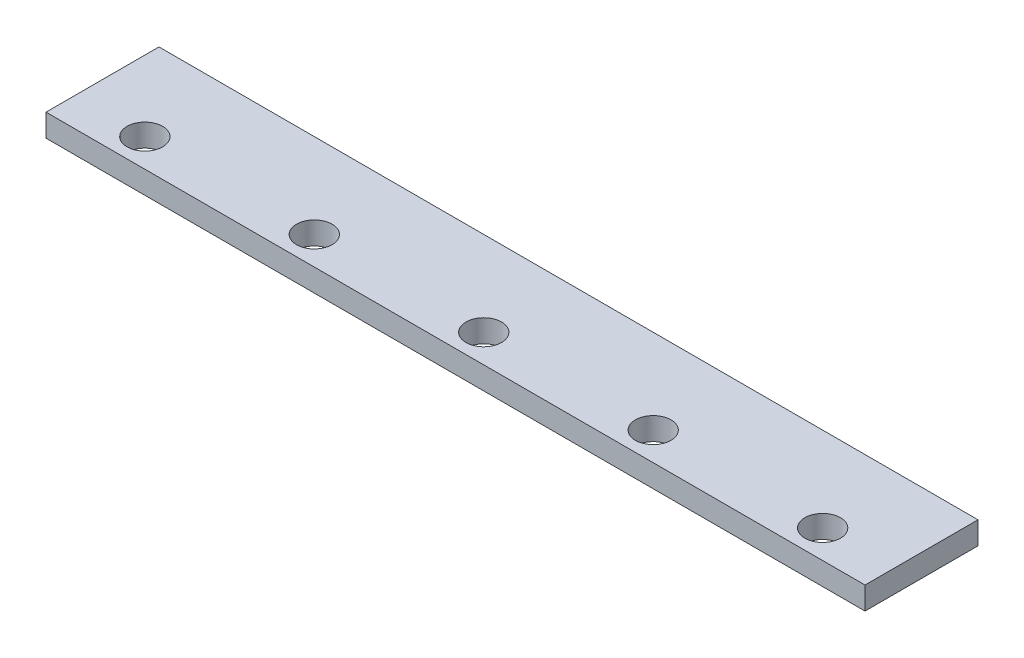
ISO-10303-21;
HEADER;
FILE_DESCRIPTION(('STEP AP214'),'2;1');
FILE_NAME('part.step','',(''),(''),'','','');
FILE_SCHEMA(('AUTOMOTIVE_DESIGN { 1 0 10303 214 1 1 1 1 }'));
ENDSEC;
DATA;
#1=APPLICATION_CONTEXT('core data for automotive mechanical design processes');
#2=APPLICATION_PROTOCOL_DEFINITION('international standard','automotive_design',2000,#1);
#3=PRODUCT_CONTEXT('',#1,'mechanical');
#4=PRODUCT('Part','Part','',(#3));
#5=PRODUCT_RELATED_PRODUCT_CATEGORY('part','',(#4));
#6=PRODUCT_DEFINITION_FORMATION('','',#4);
#7=PRODUCT_DEFINITION_CONTEXT('part definition',#1,'design');
#8=PRODUCT_DEFINITION('design','',#6,#7);
#9=PRODUCT_DEFINITION_SHAPE('','',#8);
#10=(LENGTH_UNIT() NAMED_UNIT(*) SI_UNIT(.MILLI.,.METRE.));
#11=(NAMED_UNIT(*) PLANE_ANGLE_UNIT() SI_UNIT($,.RADIAN.));
#12=(NAMED_UNIT(*) SI_UNIT($,.STERADIAN.) SOLID_ANGLE_UNIT());
#13=UNCERTAINTY_MEASURE_WITH_UNIT(LENGTH_MEASURE(1.E-05),#10,'distance_accuracy_value','');
#14=(GEOMETRIC_REPRESENTATION_CONTEXT(3) GLOBAL_UNCERTAINTY_ASSIGNED_CONTEXT((#13)) GLOBAL_UNIT_ASSIGNED_CONTEXT((#10,
#11,#12)) REPRESENTATION_CONTEXT('',''));
#15=CARTESIAN_POINT('',(0.,0.,0.));
#16=DIRECTION('',(0.,0.,1.));
#17=DIRECTION('',(1.,0.,0.));
#18=AXIS2_PLACEMENT_3D('',#15,#16,#17);
#19=CARTESIAN_POINT('',(0.,16.,0.));
#20=DIRECTION('',(0.,1.,0.));
#21=DIRECTION('',(0.,0.,1.));
#22=AXIS2_PLACEMENT_3D('',#19,#20,#21);
#23=PLANE('',#22);
#24=CARTESIAN_POINT('',(410.,16.,-20.));
#25=DIRECTION('',(0.,1.,0.));
#26=DIRECTION('',(0.,0.,1.));
#27=AXIS2_PLACEMENT_3D('',#24,#25,#26);
#28=CIRCLE('',#27,12.6);
#29=CARTESIAN_POINT('',(410.,16.,-7.40000000000001));
#30=VERTEX_POINT('',#29);
#31=EDGE_CURVE('E127',#30,#30,#28,.T.);
#32=ORIENTED_EDGE('',*,*,#31,.F.);
#33=EDGE_LOOP('',(#32));
#34=FACE_BOUND('',#33,.T.);
#35=CARTESIAN_POINT('',(170.,16.,-20.));
#36=DIRECTION('',(0.,1.,0.));
#37=DIRECTION('',(0.,0.,1.));
#38=AXIS2_PLACEMENT_3D('',#35,#36,#37);
#39=CIRCLE('',#38,12.6);
#40=CARTESIAN_POINT('',(170.,16.,-7.40000000000003));
#41=VERTEX_POINT('',#40);
#42=EDGE_CURVE('E115',#41,#41,#39,.T.);
#43=ORIENTED_EDGE('',*,*,#42,.F.);
#44=EDGE_LOOP('',(#43));
#45=FACE_BOUND('',#44,.T.);
#46=DIRECTION('',(0.,0.,1.));
#47=VECTOR('',#46,1.);
#48=CARTESIAN_POINT('',(0.,16.,-80.));
#49=LINE('',#48,#47);
#50=CARTESIAN_POINT('',(0.,16.,-80.));
#51=VERTEX_POINT('',#50);
#52=CARTESIAN_POINT('',(0.,16.,0.));
#53=VERTEX_POINT('',#52);
#54=EDGE_CURVE('E85',#51,#53,#49,.T.);
#55=ORIENTED_EDGE('',*,*,#54,.T.);
#56=DIRECTION('',(1.,0.,0.));
#57=VECTOR('',#56,1.);
#58=CARTESIAN_POINT('',(0.,16.,0.));
#59=LINE('',#58,#57);
#60=CARTESIAN_POINT('',(580.,16.,0.));
#61=VERTEX_POINT('',#60);
#62=EDGE_CURVE('E80',#53,#61,#59,.T.);
#63=ORIENTED_EDGE('',*,*,#62,.T.);
#64=DIRECTION('',(0.,0.,-1.));
#65=VECTOR('',#64,1.);
#66=CARTESIAN_POINT('',(580.,16.,0.));
#67=LINE('',#66,#65);
#68=CARTESIAN_POINT('',(580.,16.,-80.));
#69=VERTEX_POINT('',#68);
#70=EDGE_CURVE('E83',#61,#69,#67,.T.);
#71=ORIENTED_EDGE('',*,*,#70,.T.);
#72=DIRECTION('',(-1.,0.,0.));
#73=VECTOR('',#72,1.);
#74=CARTESIAN_POINT('',(580.,16.,-80.));
#75=LINE('',#74,#73);
#76=EDGE_CURVE('E50',#69,#51,#75,.T.);
#77=ORIENTED_EDGE('',*,*,#76,.T.);
#78=EDGE_LOOP('',(#55,#63,#71,#77));
#79=FACE_BOUND('',#78,.T.);
#80=CARTESIAN_POINT('',(50.,16.,-20.));
#81=DIRECTION('',(0.,1.,0.));
#82=DIRECTION('',(0.,0.,1.));
#83=AXIS2_PLACEMENT_3D('',#80,#81,#82);
#84=CIRCLE('',#83,12.6);
#85=CARTESIAN_POINT('',(50.,16.,-7.40000000000001));
#86=VERTEX_POINT('',#85);
#87=EDGE_CURVE('E100',#86,#86,#84,.T.);
#88=ORIENTED_EDGE('',*,*,#87,.F.);
#89=EDGE_LOOP('',(#88));
#90=FACE_BOUND('',#89,.T.);
#91=CARTESIAN_POINT('',(290.,16.,-20.));
#92=DIRECTION('',(0.,1.,0.));
#93=DIRECTION('',(0.,0.,1.));
#94=AXIS2_PLACEMENT_3D('',#91,#92,#93);
#95=CIRCLE('',#94,12.6);
#96=CARTESIAN_POINT('',(290.,16.,-7.40000000000001));
#97=VERTEX_POINT('',#96);
#98=EDGE_CURVE('E121',#97,#97,#95,.T.);
#99=ORIENTED_EDGE('',*,*,#98,.F.);
#100=EDGE_LOOP('',(#99));
#101=FACE_BOUND('',#100,.T.);
#102=CARTESIAN_POINT('',(530.,16.,-20.));
#103=DIRECTION('',(0.,1.,0.));
#104=DIRECTION('',(0.,0.,1.));
#105=AXIS2_PLACEMENT_3D('',#102,#103,#104);
#106=CIRCLE('',#105,12.5999999999999);
#107=CARTESIAN_POINT('',(530.,16.,-7.40000000000006));
#108=VERTEX_POINT('',#107);
#109=EDGE_CURVE('E133',#108,#108,#106,.T.);
#110=ORIENTED_EDGE('',*,*,#109,.F.);
#111=EDGE_LOOP('',(#110));
#112=FACE_BOUND('',#111,.T.);
#113=ADVANCED_FACE('F33',(#34,#45,#79,#90,#101,#112),#23,.T.);
#114=CARTESIAN_POINT('',(0.,0.,0.));
#115=DIRECTION('',(0.,1.,0.));
#116=DIRECTION('',(0.,0.,1.));
#117=AXIS2_PLACEMENT_3D('',#114,#115,#116);
#118=PLANE('',#117);
#119=DIRECTION('',(0.,0.,1.));
#120=VECTOR('',#119,1.);
#121=CARTESIAN_POINT('',(0.,0.,-80.));
#122=LINE('',#121,#120);
#123=CARTESIAN_POINT('',(0.,0.,-80.));
#124=VERTEX_POINT('',#123);
#125=CARTESIAN_POINT('',(0.,0.,0.));
#126=VERTEX_POINT('',#125);
#127=EDGE_CURVE('E97',#124,#126,#122,.T.);
#128=ORIENTED_EDGE('',*,*,#127,.F.);
#129=DIRECTION('',(-1.,0.,0.));
#130=VECTOR('',#129,1.);
#131=CARTESIAN_POINT('',(580.,0.,-80.));
#132=LINE('',#131,#130);
#133=CARTESIAN_POINT('',(580.,0.,-80.));
#134=VERTEX_POINT('',#133);
#135=EDGE_CURVE('E73',#134,#124,#132,.T.);
#136=ORIENTED_EDGE('',*,*,#135,.F.);
#137=DIRECTION('',(0.,0.,-1.));
#138=VECTOR('',#137,1.);
#139=CARTESIAN_POINT('',(580.,0.,0.));
#140=LINE('',#139,#138);
#141=CARTESIAN_POINT('',(580.,0.,0.));
#142=VERTEX_POINT('',#141);
#143=EDGE_CURVE('E67',#142,#134,#140,.T.);
#144=ORIENTED_EDGE('',*,*,#143,.F.);
#145=DIRECTION('',(1.,0.,0.));
#146=VECTOR('',#145,1.);
#147=CARTESIAN_POINT('',(0.,0.,0.));
#148=LINE('',#147,#146);
#149=EDGE_CURVE('E89',#126,#142,#148,.T.);
#150=ORIENTED_EDGE('',*,*,#149,.F.);
#151=EDGE_LOOP('',(#128,#136,#144,#150));
#152=FACE_BOUND('',#151,.T.);
#153=CARTESIAN_POINT('',(50.,0.,-20.));
#154=DIRECTION('',(0.,1.,0.));
#155=DIRECTION('',(0.,0.,1.));
#156=AXIS2_PLACEMENT_3D('',#153,#154,#155);
#157=CIRCLE('',#156,12.6);
#158=CARTESIAN_POINT('',(50.,0.,-7.40000000000001));
#159=VERTEX_POINT('',#158);
#160=EDGE_CURVE('E112',#159,#159,#157,.T.);
#161=ORIENTED_EDGE('',*,*,#160,.T.);
#162=EDGE_LOOP('',(#161));
#163=FACE_BOUND('',#162,.T.);
#164=CARTESIAN_POINT('',(170.,0.,-20.));
#165=DIRECTION('',(0.,1.,0.));
#166=DIRECTION('',(0.,0.,1.));
#167=AXIS2_PLACEMENT_3D('',#164,#165,#166);
#168=CIRCLE('',#167,12.6);
#169=CARTESIAN_POINT('',(170.,0.,-7.40000000000003));
#170=VERTEX_POINT('',#169);
#171=EDGE_CURVE('E118',#170,#170,#168,.T.);
#172=ORIENTED_EDGE('',*,*,#171,.T.);
#173=EDGE_LOOP('',(#172));
#174=FACE_BOUND('',#173,.T.);
#175=CARTESIAN_POINT('',(290.,0.,-20.));
#176=DIRECTION('',(0.,1.,0.));
#177=DIRECTION('',(0.,0.,1.));
#178=AXIS2_PLACEMENT_3D('',#175,#176,#177);
#179=CIRCLE('',#178,12.6);
#180=CARTESIAN_POINT('',(290.,0.,-7.40000000000001));
#181=VERTEX_POINT('',#180);
#182=EDGE_CURVE('E124',#181,#181,#179,.T.);
#183=ORIENTED_EDGE('',*,*,#182,.T.);
#184=EDGE_LOOP('',(#183));
#185=FACE_BOUND('',#184,.T.);
#186=CARTESIAN_POINT('',(410.,0.,-20.));
#187=DIRECTION('',(0.,1.,0.));
#188=DIRECTION('',(0.,0.,1.));
#189=AXIS2_PLACEMENT_3D('',#186,#187,#188);
#190=CIRCLE('',#189,12.6);
#191=CARTESIAN_POINT('',(410.,0.,-7.40000000000001));
#192=VERTEX_POINT('',#191);
#193=EDGE_CURVE('E130',#192,#192,#190,.T.);
#194=ORIENTED_EDGE('',*,*,#193,.T.);
#195=EDGE_LOOP('',(#194));
#196=FACE_BOUND('',#195,.T.);
#197=CARTESIAN_POINT('',(530.,0.,-20.));
#198=DIRECTION('',(0.,1.,0.));
#199=DIRECTION('',(0.,0.,1.));
#200=AXIS2_PLACEMENT_3D('',#197,#198,#199);
#201=CIRCLE('',#200,12.5999999999999);
#202=CARTESIAN_POINT('',(530.,0.,-7.40000000000006));
#203=VERTEX_POINT('',#202);
#204=EDGE_CURVE('E136',#203,#203,#201,.T.);
#205=ORIENTED_EDGE('',*,*,#204,.T.);
#206=EDGE_LOOP('',(#205));
#207=FACE_BOUND('',#206,.T.);
#208=ADVANCED_FACE('F108',(#152,#163,#174,#185,#196,#207),#118,.F.);
#209=CARTESIAN_POINT('',(0.,16.,-80.));
#210=DIRECTION('',(1.,0.,0.));
#211=DIRECTION('',(0.,0.,-1.));
#212=AXIS2_PLACEMENT_3D('',#209,#210,#211);
#213=PLANE('',#212);
#214=ORIENTED_EDGE('',*,*,#127,.T.);
#215=DIRECTION('',(0.,-1.,0.));
#216=VECTOR('',#215,1.);
#217=CARTESIAN_POINT('',(0.,16.,0.));
#218=LINE('',#217,#216);
#219=EDGE_CURVE('E11',#53,#126,#218,.T.);
#220=ORIENTED_EDGE('',*,*,#219,.F.);
#221=ORIENTED_EDGE('',*,*,#54,.F.);
#222=DIRECTION('',(0.,-1.,0.));
#223=VECTOR('',#222,1.);
#224=CARTESIAN_POINT('',(0.,16.,-80.));
#225=LINE('',#224,#223);
#226=EDGE_CURVE('E93',#51,#124,#225,.T.);
#227=ORIENTED_EDGE('',*,*,#226,.T.);
#228=EDGE_LOOP('',(#214,#220,#221,#227));
#229=FACE_BOUND('',#228,.T.);
#230=ADVANCED_FACE('F35',(#229),#213,.F.);
#231=CARTESIAN_POINT('',(0.,16.,0.));
#232=DIRECTION('',(0.,0.,-1.));
#233=DIRECTION('',(-1.,0.,0.));
#234=AXIS2_PLACEMENT_3D('',#231,#232,#233);
#235=PLANE('',#234);
#236=ORIENTED_EDGE('',*,*,#149,.T.);
#237=DIRECTION('',(0.,-1.,0.));
#238=VECTOR('',#237,1.);
#239=CARTESIAN_POINT('',(580.,16.,0.));
#240=LINE('',#239,#238);
#241=EDGE_CURVE('E42',#61,#142,#240,.T.);
#242=ORIENTED_EDGE('',*,*,#241,.F.);
#243=ORIENTED_EDGE('',*,*,#62,.F.);
#244=ORIENTED_EDGE('',*,*,#219,.T.);
#245=EDGE_LOOP('',(#236,#242,#243,#244));
#246=FACE_BOUND('',#245,.T.);
#247=ADVANCED_FACE('F88',(#246),#235,.F.);
#248=CARTESIAN_POINT('',(580.,16.,0.));
#249=DIRECTION('',(-1.,0.,0.));
#250=DIRECTION('',(0.,0.,1.));
#251=AXIS2_PLACEMENT_3D('',#248,#249,#250);
#252=PLANE('',#251);
#253=ORIENTED_EDGE('',*,*,#143,.T.);
#254=DIRECTION('',(0.,-1.,0.));
#255=VECTOR('',#254,1.);
#256=CARTESIAN_POINT('',(580.,16.,-80.));
#257=LINE('',#256,#255);
#258=EDGE_CURVE('E90',#69,#134,#257,.T.);
#259=ORIENTED_EDGE('',*,*,#258,.F.);
#260=ORIENTED_EDGE('',*,*,#70,.F.);
#261=ORIENTED_EDGE('',*,*,#241,.T.);
#262=EDGE_LOOP('',(#253,#259,#260,#261));
#263=FACE_BOUND('',#262,.T.);
#264=ADVANCED_FACE('F91',(#263),#252,.F.);
#265=CARTESIAN_POINT('',(580.,16.,-80.));
#266=DIRECTION('',(0.,0.,1.));
#267=DIRECTION('',(1.,0.,0.));
#268=AXIS2_PLACEMENT_3D('',#265,#266,#267);
#269=PLANE('',#268);
#270=ORIENTED_EDGE('',*,*,#135,.T.);
#271=ORIENTED_EDGE('',*,*,#226,.F.);
#272=ORIENTED_EDGE('',*,*,#76,.F.);
#273=ORIENTED_EDGE('',*,*,#258,.T.);
#274=EDGE_LOOP('',(#270,#271,#272,#273));
#275=FACE_BOUND('',#274,.T.);
#276=ADVANCED_FACE('F105',(#275),#269,.F.);
#277=CARTESIAN_POINT('',(50.,16.,-20.));
#278=DIRECTION('',(0.,-1.,0.));
#279=DIRECTION('',(0.,0.,-1.));
#280=AXIS2_PLACEMENT_3D('',#277,#278,#279);
#281=CYLINDRICAL_SURFACE('',#280,12.6);
#282=ORIENTED_EDGE('',*,*,#87,.T.);
#283=EDGE_LOOP('',(#282));
#284=FACE_BOUND('',#283,.T.);
#285=ORIENTED_EDGE('',*,*,#160,.F.);
#286=EDGE_LOOP('',(#285));
#287=FACE_BOUND('',#286,.T.);
#288=ADVANCED_FACE('F155',(#284,#287),#281,.F.);
#289=CARTESIAN_POINT('',(170.,16.,-20.));
#290=DIRECTION('',(0.,-1.,0.));
#291=DIRECTION('',(0.,0.,-1.));
#292=AXIS2_PLACEMENT_3D('',#289,#290,#291);
#293=CYLINDRICAL_SURFACE('',#292,12.6);
#294=ORIENTED_EDGE('',*,*,#42,.T.);
#295=EDGE_LOOP('',(#294));
#296=FACE_BOUND('',#295,.T.);
#297=ORIENTED_EDGE('',*,*,#171,.F.);
#298=EDGE_LOOP('',(#297));
#299=FACE_BOUND('',#298,.T.);
#300=ADVANCED_FACE('F201',(#296,#299),#293,.F.);
#301=CARTESIAN_POINT('',(290.,16.,-20.));
#302=DIRECTION('',(0.,-1.,0.));
#303=DIRECTION('',(0.,0.,-1.));
#304=AXIS2_PLACEMENT_3D('',#301,#302,#303);
#305=CYLINDRICAL_SURFACE('',#304,12.6);
#306=ORIENTED_EDGE('',*,*,#98,.T.);
#307=EDGE_LOOP('',(#306));
#308=FACE_BOUND('',#307,.T.);
#309=ORIENTED_EDGE('',*,*,#182,.F.);
#310=EDGE_LOOP('',(#309));
#311=FACE_BOUND('',#310,.T.);
#312=ADVANCED_FACE('F209',(#308,#311),#305,.F.);
#313=CARTESIAN_POINT('',(410.,16.,-20.));
#314=DIRECTION('',(0.,-1.,0.));
#315=DIRECTION('',(0.,0.,-1.));
#316=AXIS2_PLACEMENT_3D('',#313,#314,#315);
#317=CYLINDRICAL_SURFACE('',#316,12.6);
#318=ORIENTED_EDGE('',*,*,#31,.T.);
#319=EDGE_LOOP('',(#318));
#320=FACE_BOUND('',#319,.T.);
#321=ORIENTED_EDGE('',*,*,#193,.F.);
#322=EDGE_LOOP('',(#321));
#323=FACE_BOUND('',#322,.T.);
#324=ADVANCED_FACE('F217',(#320,#323),#317,.F.);
#325=CARTESIAN_POINT('',(530.,16.,-20.));
#326=DIRECTION('',(0.,-1.,0.));
#327=DIRECTION('',(0.,0.,-1.));
#328=AXIS2_PLACEMENT_3D('',#325,#326,#327);
#329=CYLINDRICAL_SURFACE('',#328,12.5999999999999);
#330=ORIENTED_EDGE('',*,*,#109,.T.);
#331=EDGE_LOOP('',(#330));
#332=FACE_BOUND('',#331,.T.);
#333=ORIENTED_EDGE('',*,*,#204,.F.);
#334=EDGE_LOOP('',(#333));
#335=FACE_BOUND('',#334,.T.);
#336=ADVANCED_FACE('F142',(#332,#335),#329,.F.);
#337=CLOSED_SHELL('',(#113,#208,#230,#247,#264,#276,#288,#300,#312,#324,#336));
#338=MANIFOLD_SOLID_BREP('B2',#337);
#339=ADVANCED_BREP_SHAPE_REPRESENTATION('',(#18,#338),#14);
#340=SHAPE_DEFINITION_REPRESENTATION(#9,#339);
ENDSEC;
END-ISO-10303-21;
